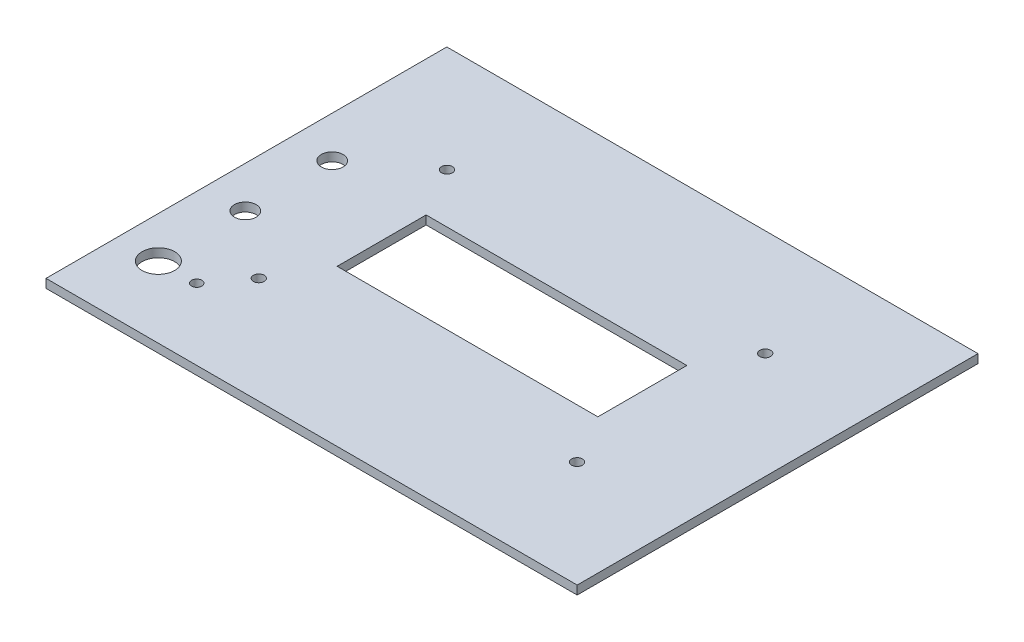
ISO-10303-21;
HEADER;
FILE_DESCRIPTION(('STEP AP214'),'2;1');
FILE_NAME('part.step','',(''),(''),'','','');
FILE_SCHEMA(('AUTOMOTIVE_DESIGN { 1 0 10303 214 1 1 1 1 }'));
ENDSEC;
DATA;
#1=APPLICATION_CONTEXT('core data for automotive mechanical design processes');
#2=APPLICATION_PROTOCOL_DEFINITION('international standard','automotive_design',2000,#1);
#3=PRODUCT_CONTEXT('',#1,'mechanical');
#4=PRODUCT('Part','Part','',(#3));
#5=PRODUCT_RELATED_PRODUCT_CATEGORY('part','',(#4));
#6=PRODUCT_DEFINITION_FORMATION('','',#4);
#7=PRODUCT_DEFINITION_CONTEXT('part definition',#1,'design');
#8=PRODUCT_DEFINITION('design','',#6,#7);
#9=PRODUCT_DEFINITION_SHAPE('','',#8);
#10=(LENGTH_UNIT() NAMED_UNIT(*) SI_UNIT(.MILLI.,.METRE.));
#11=(NAMED_UNIT(*) PLANE_ANGLE_UNIT() SI_UNIT($,.RADIAN.));
#12=(NAMED_UNIT(*) SI_UNIT($,.STERADIAN.) SOLID_ANGLE_UNIT());
#13=UNCERTAINTY_MEASURE_WITH_UNIT(LENGTH_MEASURE(1.E-05),#10,'distance_accuracy_value','');
#14=(GEOMETRIC_REPRESENTATION_CONTEXT(3) GLOBAL_UNCERTAINTY_ASSIGNED_CONTEXT((#13)) GLOBAL_UNIT_ASSIGNED_CONTEXT((#10,
#11,#12)) REPRESENTATION_CONTEXT('',''));
#15=CARTESIAN_POINT('',(0.,0.,0.));
#16=DIRECTION('',(0.,0.,1.));
#17=DIRECTION('',(1.,0.,0.));
#18=AXIS2_PLACEMENT_3D('',#15,#16,#17);
#19=CARTESIAN_POINT('',(0.,2.54,0.));
#20=DIRECTION('',(1.,0.,0.));
#21=DIRECTION('',(0.,0.,-1.));
#22=AXIS2_PLACEMENT_3D('',#19,#20,#21);
#23=PLANE('',#22);
#24=DIRECTION('',(0.,0.,1.));
#25=VECTOR('',#24,1.);
#26=CARTESIAN_POINT('',(0.,0.,0.));
#27=LINE('',#26,#25);
#28=CARTESIAN_POINT('',(0.,0.,-117.1448));
#29=VERTEX_POINT('',#28);
#30=CARTESIAN_POINT('',(0.,0.,0.));
#31=VERTEX_POINT('',#30);
#32=EDGE_CURVE('E134',#29,#31,#27,.T.);
#33=ORIENTED_EDGE('',*,*,#32,.T.);
#34=DIRECTION('',(0.,-1.,0.));
#35=VECTOR('',#34,1.);
#36=CARTESIAN_POINT('',(0.,2.54,0.));
#37=LINE('',#36,#35);
#38=CARTESIAN_POINT('',(0.,2.54,0.));
#39=VERTEX_POINT('',#38);
#40=EDGE_CURVE('E11',#39,#31,#37,.T.);
#41=ORIENTED_EDGE('',*,*,#40,.F.);
#42=DIRECTION('',(0.,0.,1.));
#43=VECTOR('',#42,1.);
#44=CARTESIAN_POINT('',(0.,2.54,0.));
#45=LINE('',#44,#43);
#46=CARTESIAN_POINT('',(0.,2.54,-117.1448));
#47=VERTEX_POINT('',#46);
#48=EDGE_CURVE('E138',#47,#39,#45,.T.);
#49=ORIENTED_EDGE('',*,*,#48,.F.);
#50=DIRECTION('',(0.,-1.,0.));
#51=VECTOR('',#50,1.);
#52=CARTESIAN_POINT('',(0.,2.54,-117.1448));
#53=LINE('',#52,#51);
#54=EDGE_CURVE('E148',#47,#29,#53,.T.);
#55=ORIENTED_EDGE('',*,*,#54,.T.);
#56=EDGE_LOOP('',(#33,#41,#49,#55));
#57=FACE_BOUND('',#56,.T.);
#58=ADVANCED_FACE('F33',(#57),#23,.F.);
#59=CARTESIAN_POINT('',(0.,2.54,0.));
#60=DIRECTION('',(0.,0.,-1.));
#61=DIRECTION('',(-1.,0.,0.));
#62=AXIS2_PLACEMENT_3D('',#59,#60,#61);
#63=PLANE('',#62);
#64=DIRECTION('',(1.,0.,0.));
#65=VECTOR('',#64,1.);
#66=CARTESIAN_POINT('',(0.,0.,0.));
#67=LINE('',#66,#65);
#68=CARTESIAN_POINT('',(155.2448,0.,0.));
#69=VERTEX_POINT('',#68);
#70=EDGE_CURVE('E151',#31,#69,#67,.T.);
#71=ORIENTED_EDGE('',*,*,#70,.T.);
#72=DIRECTION('',(0.,-1.,0.));
#73=VECTOR('',#72,1.);
#74=CARTESIAN_POINT('',(155.2448,2.54,0.));
#75=LINE('',#74,#73);
#76=CARTESIAN_POINT('',(155.2448,2.54,0.));
#77=VERTEX_POINT('',#76);
#78=EDGE_CURVE('E40',#77,#69,#75,.T.);
#79=ORIENTED_EDGE('',*,*,#78,.F.);
#80=DIRECTION('',(1.,0.,0.));
#81=VECTOR('',#80,1.);
#82=CARTESIAN_POINT('',(0.,2.54,0.));
#83=LINE('',#82,#81);
#84=EDGE_CURVE('E141',#39,#77,#83,.T.);
#85=ORIENTED_EDGE('',*,*,#84,.F.);
#86=ORIENTED_EDGE('',*,*,#40,.T.);
#87=EDGE_LOOP('',(#71,#79,#85,#86));
#88=FACE_BOUND('',#87,.T.);
#89=ADVANCED_FACE('F179',(#88),#63,.F.);
#90=CARTESIAN_POINT('',(155.2448,2.54,0.));
#91=DIRECTION('',(-1.,0.,0.));
#92=DIRECTION('',(0.,0.,1.));
#93=AXIS2_PLACEMENT_3D('',#90,#91,#92);
#94=PLANE('',#93);
#95=DIRECTION('',(0.,0.,-1.));
#96=VECTOR('',#95,1.);
#97=CARTESIAN_POINT('',(155.2448,0.,0.));
#98=LINE('',#97,#96);
#99=CARTESIAN_POINT('',(155.2448,0.,-117.1448));
#100=VERTEX_POINT('',#99);
#101=EDGE_CURVE('E153',#69,#100,#98,.T.);
#102=ORIENTED_EDGE('',*,*,#101,.T.);
#103=DIRECTION('',(0.,-1.,0.));
#104=VECTOR('',#103,1.);
#105=CARTESIAN_POINT('',(155.2448,2.54,-117.1448));
#106=LINE('',#105,#104);
#107=CARTESIAN_POINT('',(155.2448,2.54,-117.1448));
#108=VERTEX_POINT('',#107);
#109=EDGE_CURVE('E158',#108,#100,#106,.T.);
#110=ORIENTED_EDGE('',*,*,#109,.F.);
#111=DIRECTION('',(0.,0.,-1.));
#112=VECTOR('',#111,1.);
#113=CARTESIAN_POINT('',(155.2448,2.54,0.));
#114=LINE('',#113,#112);
#115=EDGE_CURVE('E144',#77,#108,#114,.T.);
#116=ORIENTED_EDGE('',*,*,#115,.F.);
#117=ORIENTED_EDGE('',*,*,#78,.T.);
#118=EDGE_LOOP('',(#102,#110,#116,#117));
#119=FACE_BOUND('',#118,.T.);
#120=ADVANCED_FACE('F165',(#119),#94,.F.);
#121=CARTESIAN_POINT('',(0.,2.54,-117.1448));
#122=DIRECTION('',(0.,0.,1.));
#123=DIRECTION('',(1.,0.,0.));
#124=AXIS2_PLACEMENT_3D('',#121,#122,#123);
#125=PLANE('',#124);
#126=DIRECTION('',(-1.,0.,0.));
#127=VECTOR('',#126,1.);
#128=CARTESIAN_POINT('',(0.,0.,-117.1448));
#129=LINE('',#128,#127);
#130=EDGE_CURVE('E142',#100,#29,#129,.T.);
#131=ORIENTED_EDGE('',*,*,#130,.T.);
#132=ORIENTED_EDGE('',*,*,#54,.F.);
#133=DIRECTION('',(-1.,0.,0.));
#134=VECTOR('',#133,1.);
#135=CARTESIAN_POINT('',(0.,2.54,-117.1448));
#136=LINE('',#135,#134);
#137=EDGE_CURVE('E146',#108,#47,#136,.T.);
#138=ORIENTED_EDGE('',*,*,#137,.F.);
#139=ORIENTED_EDGE('',*,*,#109,.T.);
#140=EDGE_LOOP('',(#131,#132,#138,#139));
#141=FACE_BOUND('',#140,.T.);
#142=ADVANCED_FACE('F172',(#141),#125,.F.);
#143=CARTESIAN_POINT('',(0.,2.54,0.));
#144=DIRECTION('',(0.,-1.,0.));
#145=DIRECTION('',(0.,0.,-1.));
#146=AXIS2_PLACEMENT_3D('',#143,#144,#145);
#147=PLANE('',#146);
#148=CARTESIAN_POINT('',(23.247,2.54,-20.7978));
#149=DIRECTION('',(0.,1.,0.));
#150=DIRECTION('',(0.,0.,1.));
#151=AXIS2_PLACEMENT_3D('',#148,#149,#150);
#152=CIRCLE('',#151,1.5);
#153=CARTESIAN_POINT('',(23.247,2.54,-19.2978));
#154=VERTEX_POINT('',#153);
#155=EDGE_CURVE('E245',#154,#154,#152,.T.);
#156=ORIENTED_EDGE('',*,*,#155,.F.);
#157=EDGE_LOOP('',(#156));
#158=FACE_BOUND('',#157,.T.);
#159=CARTESIAN_POINT('',(12.047,2.54,-20.7978));
#160=DIRECTION('',(0.,1.,0.));
#161=DIRECTION('',(0.,0.,1.));
#162=AXIS2_PLACEMENT_3D('',#159,#160,#161);
#163=CIRCLE('',#162,4.7625);
#164=CARTESIAN_POINT('',(12.047,2.54,-16.0353));
#165=VERTEX_POINT('',#164);
#166=EDGE_CURVE('E247',#165,#165,#163,.T.);
#167=ORIENTED_EDGE('',*,*,#166,.F.);
#168=EDGE_LOOP('',(#167));
#169=FACE_BOUND('',#168,.T.);
#170=CARTESIAN_POINT('',(12.047,2.54,-46.1978));
#171=DIRECTION('',(0.,1.,0.));
#172=DIRECTION('',(0.,0.,1.));
#173=AXIS2_PLACEMENT_3D('',#170,#171,#172);
#174=CIRCLE('',#173,3.175);
#175=CARTESIAN_POINT('',(12.047,2.54,-43.0228));
#176=VERTEX_POINT('',#175);
#177=EDGE_CURVE('E253',#176,#176,#174,.T.);
#178=ORIENTED_EDGE('',*,*,#177,.F.);
#179=EDGE_LOOP('',(#178));
#180=FACE_BOUND('',#179,.T.);
#181=CARTESIAN_POINT('',(12.047,2.54,-71.5978));
#182=DIRECTION('',(0.,1.,0.));
#183=DIRECTION('',(0.,0.,1.));
#184=AXIS2_PLACEMENT_3D('',#181,#182,#183);
#185=CIRCLE('',#184,3.175);
#186=CARTESIAN_POINT('',(12.047,2.54,-68.4228));
#187=VERTEX_POINT('',#186);
#188=EDGE_CURVE('E259',#187,#187,#185,.T.);
#189=ORIENTED_EDGE('',*,*,#188,.F.);
#190=EDGE_LOOP('',(#189));
#191=FACE_BOUND('',#190,.T.);
#192=CARTESIAN_POINT('',(124.097,2.54,-31.0978));
#193=DIRECTION('',(0.,1.,0.));
#194=DIRECTION('',(0.,0.,1.));
#195=AXIS2_PLACEMENT_3D('',#192,#193,#194);
#196=CIRCLE('',#195,1.58749999999999);
#197=CARTESIAN_POINT('',(124.097,2.54,-29.5103));
#198=VERTEX_POINT('',#197);
#199=EDGE_CURVE('E265',#198,#198,#196,.T.);
#200=ORIENTED_EDGE('',*,*,#199,.F.);
#201=EDGE_LOOP('',(#200));
#202=FACE_BOUND('',#201,.T.);
#203=CARTESIAN_POINT('',(124.097,2.54,-86.0978));
#204=DIRECTION('',(0.,1.,0.));
#205=DIRECTION('',(0.,0.,1.));
#206=AXIS2_PLACEMENT_3D('',#203,#204,#205);
#207=CIRCLE('',#206,1.58749999999999);
#208=CARTESIAN_POINT('',(124.097,2.54,-84.5103));
#209=VERTEX_POINT('',#208);
#210=EDGE_CURVE('E271',#209,#209,#207,.T.);
#211=ORIENTED_EDGE('',*,*,#210,.F.);
#212=EDGE_LOOP('',(#211));
#213=FACE_BOUND('',#212,.T.);
#214=CARTESIAN_POINT('',(31.097,2.54,-31.0978));
#215=DIRECTION('',(0.,1.,0.));
#216=DIRECTION('',(0.,0.,1.));
#217=AXIS2_PLACEMENT_3D('',#214,#215,#216);
#218=CIRCLE('',#217,1.5875);
#219=CARTESIAN_POINT('',(31.097,2.54,-29.5103));
#220=VERTEX_POINT('',#219);
#221=EDGE_CURVE('E277',#220,#220,#218,.T.);
#222=ORIENTED_EDGE('',*,*,#221,.F.);
#223=EDGE_LOOP('',(#222));
#224=FACE_BOUND('',#223,.T.);
#225=CARTESIAN_POINT('',(31.097,2.54,-86.0978));
#226=DIRECTION('',(0.,1.,0.));
#227=DIRECTION('',(0.,0.,1.));
#228=AXIS2_PLACEMENT_3D('',#225,#226,#227);
#229=CIRCLE('',#228,1.5875);
#230=CARTESIAN_POINT('',(31.097,2.54,-84.5103));
#231=VERTEX_POINT('',#230);
#232=EDGE_CURVE('E121',#231,#231,#229,.T.);
#233=ORIENTED_EDGE('',*,*,#232,.F.);
#234=EDGE_LOOP('',(#233));
#235=FACE_BOUND('',#234,.T.);
#236=DIRECTION('',(1.,0.,0.));
#237=VECTOR('',#236,1.);
#238=CARTESIAN_POINT('',(39.497,2.54,-45.5978));
#239=LINE('',#238,#237);
#240=CARTESIAN_POINT('',(39.497,2.54,-45.5978));
#241=VERTEX_POINT('',#240);
#242=CARTESIAN_POINT('',(115.697,2.54,-45.5978));
#243=VERTEX_POINT('',#242);
#244=EDGE_CURVE('E127',#241,#243,#239,.T.);
#245=ORIENTED_EDGE('',*,*,#244,.F.);
#246=DIRECTION('',(0.,0.,1.));
#247=VECTOR('',#246,1.);
#248=CARTESIAN_POINT('',(39.497,2.54,-71.5978));
#249=LINE('',#248,#247);
#250=CARTESIAN_POINT('',(39.497,2.54,-71.5978));
#251=VERTEX_POINT('',#250);
#252=EDGE_CURVE('E47',#251,#241,#249,.T.);
#253=ORIENTED_EDGE('',*,*,#252,.F.);
#254=DIRECTION('',(-1.,0.,0.));
#255=VECTOR('',#254,1.);
#256=CARTESIAN_POINT('',(39.497,2.54,-71.5978));
#257=LINE('',#256,#255);
#258=CARTESIAN_POINT('',(115.697,2.54,-71.5978));
#259=VERTEX_POINT('',#258);
#260=EDGE_CURVE('E115',#259,#251,#257,.T.);
#261=ORIENTED_EDGE('',*,*,#260,.F.);
#262=DIRECTION('',(0.,0.,-1.));
#263=VECTOR('',#262,1.);
#264=CARTESIAN_POINT('',(115.697,2.54,-71.5978));
#265=LINE('',#264,#263);
#266=EDGE_CURVE('E118',#243,#259,#265,.T.);
#267=ORIENTED_EDGE('',*,*,#266,.F.);
#268=EDGE_LOOP('',(#245,#253,#261,#267));
#269=FACE_BOUND('',#268,.T.);
#270=ORIENTED_EDGE('',*,*,#48,.T.);
#271=ORIENTED_EDGE('',*,*,#84,.T.);
#272=ORIENTED_EDGE('',*,*,#115,.T.);
#273=ORIENTED_EDGE('',*,*,#137,.T.);
#274=EDGE_LOOP('',(#270,#271,#272,#273));
#275=FACE_BOUND('',#274,.T.);
#276=ADVANCED_FACE('F178',(#158,#169,#180,#191,#202,#213,#224,#235,#269,#275),#147,.F.);
#277=CARTESIAN_POINT('',(0.,0.,0.));
#278=DIRECTION('',(0.,-1.,0.));
#279=DIRECTION('',(0.,0.,-1.));
#280=AXIS2_PLACEMENT_3D('',#277,#278,#279);
#281=PLANE('',#280);
#282=CARTESIAN_POINT('',(23.247,0.,-20.7978));
#283=DIRECTION('',(0.,1.,0.));
#284=DIRECTION('',(0.,0.,1.));
#285=AXIS2_PLACEMENT_3D('',#282,#283,#284);
#286=CIRCLE('',#285,1.5);
#287=CARTESIAN_POINT('',(23.247,0.,-19.2978));
#288=VERTEX_POINT('',#287);
#289=EDGE_CURVE('E242',#288,#288,#286,.T.);
#290=ORIENTED_EDGE('',*,*,#289,.T.);
#291=EDGE_LOOP('',(#290));
#292=FACE_BOUND('',#291,.T.);
#293=CARTESIAN_POINT('',(12.047,0.,-20.7978));
#294=DIRECTION('',(0.,1.,0.));
#295=DIRECTION('',(0.,0.,1.));
#296=AXIS2_PLACEMENT_3D('',#293,#294,#295);
#297=CIRCLE('',#296,4.7625);
#298=CARTESIAN_POINT('',(12.047,0.,-16.0353));
#299=VERTEX_POINT('',#298);
#300=EDGE_CURVE('E250',#299,#299,#297,.T.);
#301=ORIENTED_EDGE('',*,*,#300,.T.);
#302=EDGE_LOOP('',(#301));
#303=FACE_BOUND('',#302,.T.);
#304=CARTESIAN_POINT('',(12.047,0.,-46.1978));
#305=DIRECTION('',(0.,1.,0.));
#306=DIRECTION('',(0.,0.,1.));
#307=AXIS2_PLACEMENT_3D('',#304,#305,#306);
#308=CIRCLE('',#307,3.175);
#309=CARTESIAN_POINT('',(12.047,0.,-43.0228));
#310=VERTEX_POINT('',#309);
#311=EDGE_CURVE('E256',#310,#310,#308,.T.);
#312=ORIENTED_EDGE('',*,*,#311,.T.);
#313=EDGE_LOOP('',(#312));
#314=FACE_BOUND('',#313,.T.);
#315=CARTESIAN_POINT('',(12.047,0.,-71.5978));
#316=DIRECTION('',(0.,1.,0.));
#317=DIRECTION('',(0.,0.,1.));
#318=AXIS2_PLACEMENT_3D('',#315,#316,#317);
#319=CIRCLE('',#318,3.175);
#320=CARTESIAN_POINT('',(12.047,0.,-68.4228));
#321=VERTEX_POINT('',#320);
#322=EDGE_CURVE('E262',#321,#321,#319,.T.);
#323=ORIENTED_EDGE('',*,*,#322,.T.);
#324=EDGE_LOOP('',(#323));
#325=FACE_BOUND('',#324,.T.);
#326=CARTESIAN_POINT('',(124.097,0.,-31.0978));
#327=DIRECTION('',(0.,1.,0.));
#328=DIRECTION('',(0.,0.,1.));
#329=AXIS2_PLACEMENT_3D('',#326,#327,#328);
#330=CIRCLE('',#329,1.58749999999999);
#331=CARTESIAN_POINT('',(124.097,0.,-29.5103));
#332=VERTEX_POINT('',#331);
#333=EDGE_CURVE('E268',#332,#332,#330,.T.);
#334=ORIENTED_EDGE('',*,*,#333,.T.);
#335=EDGE_LOOP('',(#334));
#336=FACE_BOUND('',#335,.T.);
#337=CARTESIAN_POINT('',(124.097,0.,-86.0978));
#338=DIRECTION('',(0.,1.,0.));
#339=DIRECTION('',(0.,0.,1.));
#340=AXIS2_PLACEMENT_3D('',#337,#338,#339);
#341=CIRCLE('',#340,1.58749999999999);
#342=CARTESIAN_POINT('',(124.097,0.,-84.5103));
#343=VERTEX_POINT('',#342);
#344=EDGE_CURVE('E274',#343,#343,#341,.T.);
#345=ORIENTED_EDGE('',*,*,#344,.T.);
#346=EDGE_LOOP('',(#345));
#347=FACE_BOUND('',#346,.T.);
#348=CARTESIAN_POINT('',(31.097,0.,-31.0978));
#349=DIRECTION('',(0.,1.,0.));
#350=DIRECTION('',(0.,0.,1.));
#351=AXIS2_PLACEMENT_3D('',#348,#349,#350);
#352=CIRCLE('',#351,1.5875);
#353=CARTESIAN_POINT('',(31.097,0.,-29.5103));
#354=VERTEX_POINT('',#353);
#355=EDGE_CURVE('E280',#354,#354,#352,.T.);
#356=ORIENTED_EDGE('',*,*,#355,.T.);
#357=EDGE_LOOP('',(#356));
#358=FACE_BOUND('',#357,.T.);
#359=CARTESIAN_POINT('',(31.097,0.,-86.0978));
#360=DIRECTION('',(0.,1.,0.));
#361=DIRECTION('',(0.,0.,1.));
#362=AXIS2_PLACEMENT_3D('',#359,#360,#361);
#363=CIRCLE('',#362,1.5875);
#364=CARTESIAN_POINT('',(31.097,0.,-84.5103));
#365=VERTEX_POINT('',#364);
#366=EDGE_CURVE('E128',#365,#365,#363,.T.);
#367=ORIENTED_EDGE('',*,*,#366,.T.);
#368=EDGE_LOOP('',(#367));
#369=FACE_BOUND('',#368,.T.);
#370=DIRECTION('',(0.,0.,1.));
#371=VECTOR('',#370,1.);
#372=CARTESIAN_POINT('',(39.497,0.,-71.5978));
#373=LINE('',#372,#371);
#374=CARTESIAN_POINT('',(39.497,0.,-71.5978));
#375=VERTEX_POINT('',#374);
#376=CARTESIAN_POINT('',(39.497,0.,-45.5978));
#377=VERTEX_POINT('',#376);
#378=EDGE_CURVE('E99',#375,#377,#373,.T.);
#379=ORIENTED_EDGE('',*,*,#378,.T.);
#380=DIRECTION('',(1.,0.,0.));
#381=VECTOR('',#380,1.);
#382=CARTESIAN_POINT('',(39.497,0.,-45.5978));
#383=LINE('',#382,#381);
#384=CARTESIAN_POINT('',(115.697,0.,-45.5978));
#385=VERTEX_POINT('',#384);
#386=EDGE_CURVE('E108',#377,#385,#383,.T.);
#387=ORIENTED_EDGE('',*,*,#386,.T.);
#388=DIRECTION('',(0.,0.,-1.));
#389=VECTOR('',#388,1.);
#390=CARTESIAN_POINT('',(115.697,0.,-71.5978));
#391=LINE('',#390,#389);
#392=CARTESIAN_POINT('',(115.697,0.,-71.5978));
#393=VERTEX_POINT('',#392);
#394=EDGE_CURVE('E55',#385,#393,#391,.T.);
#395=ORIENTED_EDGE('',*,*,#394,.T.);
#396=DIRECTION('',(-1.,0.,0.));
#397=VECTOR('',#396,1.);
#398=CARTESIAN_POINT('',(39.497,0.,-71.5978));
#399=LINE('',#398,#397);
#400=EDGE_CURVE('E105',#393,#375,#399,.T.);
#401=ORIENTED_EDGE('',*,*,#400,.T.);
#402=EDGE_LOOP('',(#379,#387,#395,#401));
#403=FACE_BOUND('',#402,.T.);
#404=ORIENTED_EDGE('',*,*,#32,.F.);
#405=ORIENTED_EDGE('',*,*,#130,.F.);
#406=ORIENTED_EDGE('',*,*,#101,.F.);
#407=ORIENTED_EDGE('',*,*,#70,.F.);
#408=EDGE_LOOP('',(#404,#405,#406,#407));
#409=FACE_BOUND('',#408,.T.);
#410=ADVANCED_FACE('F112',(#292,#303,#314,#325,#336,#347,#358,#369,#403,#409),#281,.T.);
#411=CARTESIAN_POINT('',(39.497,0.,-71.5978));
#412=DIRECTION('',(-1.,0.,0.));
#413=DIRECTION('',(0.,0.,1.));
#414=AXIS2_PLACEMENT_3D('',#411,#412,#413);
#415=PLANE('',#414);
#416=ORIENTED_EDGE('',*,*,#252,.T.);
#417=DIRECTION('',(0.,1.,0.));
#418=VECTOR('',#417,1.);
#419=CARTESIAN_POINT('',(39.497,0.,-45.5978));
#420=LINE('',#419,#418);
#421=EDGE_CURVE('E95',#377,#241,#420,.T.);
#422=ORIENTED_EDGE('',*,*,#421,.F.);
#423=ORIENTED_EDGE('',*,*,#378,.F.);
#424=DIRECTION('',(0.,1.,0.));
#425=VECTOR('',#424,1.);
#426=CARTESIAN_POINT('',(39.497,0.,-71.5978));
#427=LINE('',#426,#425);
#428=EDGE_CURVE('E132',#375,#251,#427,.T.);
#429=ORIENTED_EDGE('',*,*,#428,.T.);
#430=EDGE_LOOP('',(#416,#422,#423,#429));
#431=FACE_BOUND('',#430,.T.);
#432=ADVANCED_FACE('F97',(#431),#415,.F.);
#433=CARTESIAN_POINT('',(39.497,0.,-71.5978));
#434=DIRECTION('',(0.,0.,-1.));
#435=DIRECTION('',(-1.,0.,0.));
#436=AXIS2_PLACEMENT_3D('',#433,#434,#435);
#437=PLANE('',#436);
#438=ORIENTED_EDGE('',*,*,#260,.T.);
#439=ORIENTED_EDGE('',*,*,#428,.F.);
#440=ORIENTED_EDGE('',*,*,#400,.F.);
#441=DIRECTION('',(0.,1.,0.));
#442=VECTOR('',#441,1.);
#443=CARTESIAN_POINT('',(115.697,0.,-71.5978));
#444=LINE('',#443,#442);
#445=EDGE_CURVE('E135',#393,#259,#444,.T.);
#446=ORIENTED_EDGE('',*,*,#445,.T.);
#447=EDGE_LOOP('',(#438,#439,#440,#446));
#448=FACE_BOUND('',#447,.T.);
#449=ADVANCED_FACE('F197',(#448),#437,.F.);
#450=CARTESIAN_POINT('',(115.697,0.,-71.5978));
#451=DIRECTION('',(1.,0.,0.));
#452=DIRECTION('',(0.,0.,-1.));
#453=AXIS2_PLACEMENT_3D('',#450,#451,#452);
#454=PLANE('',#453);
#455=ORIENTED_EDGE('',*,*,#266,.T.);
#456=ORIENTED_EDGE('',*,*,#445,.F.);
#457=ORIENTED_EDGE('',*,*,#394,.F.);
#458=DIRECTION('',(0.,1.,0.));
#459=VECTOR('',#458,1.);
#460=CARTESIAN_POINT('',(115.697,0.,-45.5978));
#461=LINE('',#460,#459);
#462=EDGE_CURVE('E104',#385,#243,#461,.T.);
#463=ORIENTED_EDGE('',*,*,#462,.T.);
#464=EDGE_LOOP('',(#455,#456,#457,#463));
#465=FACE_BOUND('',#464,.T.);
#466=ADVANCED_FACE('F201',(#465),#454,.F.);
#467=CARTESIAN_POINT('',(39.497,0.,-45.5978));
#468=DIRECTION('',(0.,0.,1.));
#469=DIRECTION('',(1.,0.,0.));
#470=AXIS2_PLACEMENT_3D('',#467,#468,#469);
#471=PLANE('',#470);
#472=ORIENTED_EDGE('',*,*,#244,.T.);
#473=ORIENTED_EDGE('',*,*,#462,.F.);
#474=ORIENTED_EDGE('',*,*,#386,.F.);
#475=ORIENTED_EDGE('',*,*,#421,.T.);
#476=EDGE_LOOP('',(#472,#473,#474,#475));
#477=FACE_BOUND('',#476,.T.);
#478=ADVANCED_FACE('F109',(#477),#471,.F.);
#479=CARTESIAN_POINT('',(31.097,0.,-86.0978));
#480=DIRECTION('',(0.,1.,0.));
#481=DIRECTION('',(0.,0.,1.));
#482=AXIS2_PLACEMENT_3D('',#479,#480,#481);
#483=CYLINDRICAL_SURFACE('',#482,1.5875);
#484=ORIENTED_EDGE('',*,*,#366,.F.);
#485=EDGE_LOOP('',(#484));
#486=FACE_BOUND('',#485,.T.);
#487=ORIENTED_EDGE('',*,*,#232,.T.);
#488=EDGE_LOOP('',(#487));
#489=FACE_BOUND('',#488,.T.);
#490=ADVANCED_FACE('F200',(#486,#489),#483,.F.);
#491=CARTESIAN_POINT('',(31.097,0.,-31.0978));
#492=DIRECTION('',(0.,1.,0.));
#493=DIRECTION('',(0.,0.,1.));
#494=AXIS2_PLACEMENT_3D('',#491,#492,#493);
#495=CYLINDRICAL_SURFACE('',#494,1.5875);
#496=ORIENTED_EDGE('',*,*,#355,.F.);
#497=EDGE_LOOP('',(#496));
#498=FACE_BOUND('',#497,.T.);
#499=ORIENTED_EDGE('',*,*,#221,.T.);
#500=EDGE_LOOP('',(#499));
#501=FACE_BOUND('',#500,.T.);
#502=ADVANCED_FACE('F209',(#498,#501),#495,.F.);
#503=CARTESIAN_POINT('',(124.097,0.,-86.0978));
#504=DIRECTION('',(0.,1.,0.));
#505=DIRECTION('',(0.,0.,1.));
#506=AXIS2_PLACEMENT_3D('',#503,#504,#505);
#507=CYLINDRICAL_SURFACE('',#506,1.58749999999999);
#508=ORIENTED_EDGE('',*,*,#344,.F.);
#509=EDGE_LOOP('',(#508));
#510=FACE_BOUND('',#509,.T.);
#511=ORIENTED_EDGE('',*,*,#210,.T.);
#512=EDGE_LOOP('',(#511));
#513=FACE_BOUND('',#512,.T.);
#514=ADVANCED_FACE('F213',(#510,#513),#507,.F.);
#515=CARTESIAN_POINT('',(124.097,0.,-31.0978));
#516=DIRECTION('',(0.,1.,0.));
#517=DIRECTION('',(0.,0.,1.));
#518=AXIS2_PLACEMENT_3D('',#515,#516,#517);
#519=CYLINDRICAL_SURFACE('',#518,1.58749999999999);
#520=ORIENTED_EDGE('',*,*,#333,.F.);
#521=EDGE_LOOP('',(#520));
#522=FACE_BOUND('',#521,.T.);
#523=ORIENTED_EDGE('',*,*,#199,.T.);
#524=EDGE_LOOP('',(#523));
#525=FACE_BOUND('',#524,.T.);
#526=ADVANCED_FACE('F217',(#522,#525),#519,.F.);
#527=CARTESIAN_POINT('',(12.047,0.,-71.5978));
#528=DIRECTION('',(0.,1.,0.));
#529=DIRECTION('',(0.,0.,1.));
#530=AXIS2_PLACEMENT_3D('',#527,#528,#529);
#531=CYLINDRICAL_SURFACE('',#530,3.175);
#532=ORIENTED_EDGE('',*,*,#322,.F.);
#533=EDGE_LOOP('',(#532));
#534=FACE_BOUND('',#533,.T.);
#535=ORIENTED_EDGE('',*,*,#188,.T.);
#536=EDGE_LOOP('',(#535));
#537=FACE_BOUND('',#536,.T.);
#538=ADVANCED_FACE('F221',(#534,#537),#531,.F.);
#539=CARTESIAN_POINT('',(12.047,0.,-46.1978));
#540=DIRECTION('',(0.,1.,0.));
#541=DIRECTION('',(0.,0.,1.));
#542=AXIS2_PLACEMENT_3D('',#539,#540,#541);
#543=CYLINDRICAL_SURFACE('',#542,3.175);
#544=ORIENTED_EDGE('',*,*,#311,.F.);
#545=EDGE_LOOP('',(#544));
#546=FACE_BOUND('',#545,.T.);
#547=ORIENTED_EDGE('',*,*,#177,.T.);
#548=EDGE_LOOP('',(#547));
#549=FACE_BOUND('',#548,.T.);
#550=ADVANCED_FACE('F225',(#546,#549),#543,.F.);
#551=CARTESIAN_POINT('',(12.047,0.,-20.7978));
#552=DIRECTION('',(0.,1.,0.));
#553=DIRECTION('',(0.,0.,1.));
#554=AXIS2_PLACEMENT_3D('',#551,#552,#553);
#555=CYLINDRICAL_SURFACE('',#554,4.7625);
#556=ORIENTED_EDGE('',*,*,#300,.F.);
#557=EDGE_LOOP('',(#556));
#558=FACE_BOUND('',#557,.T.);
#559=ORIENTED_EDGE('',*,*,#166,.T.);
#560=EDGE_LOOP('',(#559));
#561=FACE_BOUND('',#560,.T.);
#562=ADVANCED_FACE('F229',(#558,#561),#555,.F.);
#563=CARTESIAN_POINT('',(23.247,0.,-20.7978));
#564=DIRECTION('',(0.,1.,0.));
#565=DIRECTION('',(0.,0.,1.));
#566=AXIS2_PLACEMENT_3D('',#563,#564,#565);
#567=CYLINDRICAL_SURFACE('',#566,1.5);
#568=ORIENTED_EDGE('',*,*,#289,.F.);
#569=EDGE_LOOP('',(#568));
#570=FACE_BOUND('',#569,.T.);
#571=ORIENTED_EDGE('',*,*,#155,.T.);
#572=EDGE_LOOP('',(#571));
#573=FACE_BOUND('',#572,.T.);
#574=ADVANCED_FACE('F233',(#570,#573),#567,.F.);
#575=CLOSED_SHELL('',(#58,#89,#120,#142,#276,#410,#432,#449,#466,#478,#490,#502,#514,#526,#538,
#550,#562,#574));
#576=MANIFOLD_SOLID_BREP('B2',#575);
#577=ADVANCED_BREP_SHAPE_REPRESENTATION('',(#18,#576),#14);
#578=SHAPE_DEFINITION_REPRESENTATION(#9,#577);
ENDSEC;
END-ISO-10303-21;
